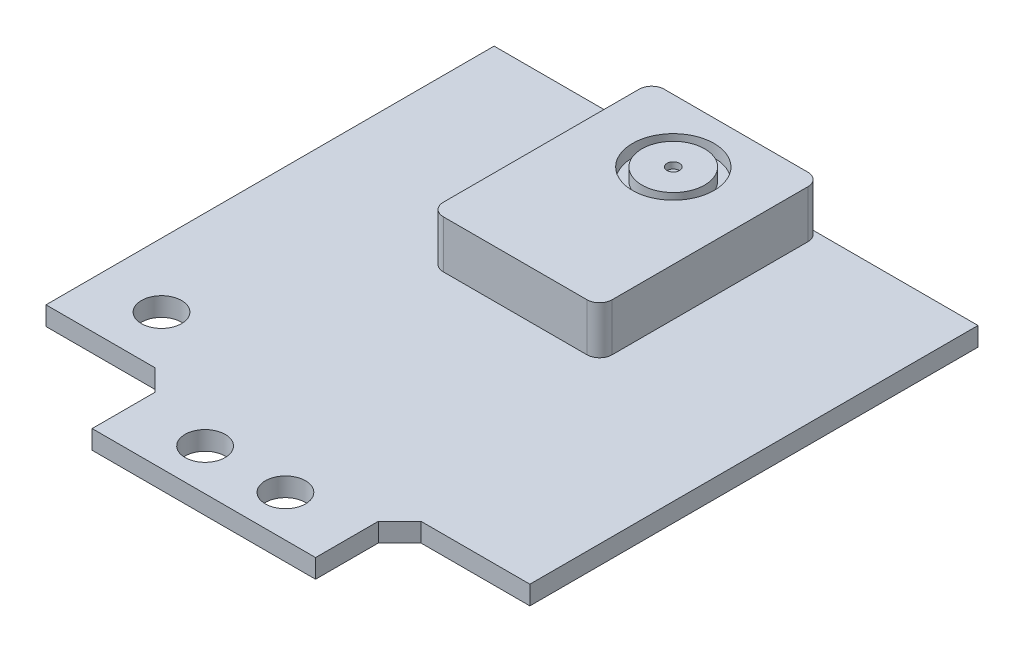
ISO-10303-21;
HEADER;
FILE_DESCRIPTION(('STEP AP214'),'2;1');
FILE_NAME('part.step','',(''),(''),'','','');
FILE_SCHEMA(('AUTOMOTIVE_DESIGN { 1 0 10303 214 1 1 1 1 }'));
ENDSEC;
DATA;
#1=APPLICATION_CONTEXT('core data for automotive mechanical design processes');
#2=APPLICATION_PROTOCOL_DEFINITION('international standard','automotive_design',2000,#1);
#3=PRODUCT_CONTEXT('',#1,'mechanical');
#4=PRODUCT('Part','Part','',(#3));
#5=PRODUCT_RELATED_PRODUCT_CATEGORY('part','',(#4));
#6=PRODUCT_DEFINITION_FORMATION('','',#4);
#7=PRODUCT_DEFINITION_CONTEXT('part definition',#1,'design');
#8=PRODUCT_DEFINITION('design','',#6,#7);
#9=PRODUCT_DEFINITION_SHAPE('','',#8);
#10=(LENGTH_UNIT() NAMED_UNIT(*) SI_UNIT(.MILLI.,.METRE.));
#11=(NAMED_UNIT(*) PLANE_ANGLE_UNIT() SI_UNIT($,.RADIAN.));
#12=(NAMED_UNIT(*) SI_UNIT($,.STERADIAN.) SOLID_ANGLE_UNIT());
#13=UNCERTAINTY_MEASURE_WITH_UNIT(LENGTH_MEASURE(1.E-05),#10,'distance_accuracy_value','');
#14=(GEOMETRIC_REPRESENTATION_CONTEXT(3) GLOBAL_UNCERTAINTY_ASSIGNED_CONTEXT((#13)) GLOBAL_UNIT_ASSIGNED_CONTEXT((#10,
#11,#12)) REPRESENTATION_CONTEXT('',''));
#15=CARTESIAN_POINT('',(0.,0.,0.));
#16=DIRECTION('',(0.,0.,1.));
#17=DIRECTION('',(1.,0.,0.));
#18=AXIS2_PLACEMENT_3D('',#15,#16,#17);
#19=CARTESIAN_POINT('',(6.725,5.3,0.));
#20=DIRECTION('',(-1.,0.,0.));
#21=DIRECTION('',(0.,0.,1.));
#22=AXIS2_PLACEMENT_3D('',#19,#20,#21);
#23=PLANE('',#22);
#24=DIRECTION('',(0.,0.,-1.));
#25=VECTOR('',#24,1.);
#26=CARTESIAN_POINT('',(6.725,1.5,0.));
#27=LINE('',#26,#25);
#28=CARTESIAN_POINT('',(6.725,1.5,-1.25));
#29=VERTEX_POINT('',#28);
#30=CARTESIAN_POINT('',(6.725,1.5,-16.85));
#31=VERTEX_POINT('',#30);
#32=EDGE_CURVE('E255',#29,#31,#27,.T.);
#33=ORIENTED_EDGE('',*,*,#32,.T.);
#34=DIRECTION('',(0.,-1.,0.));
#35=VECTOR('',#34,1.);
#36=CARTESIAN_POINT('',(6.725,5.3,-16.85));
#37=LINE('',#36,#35);
#38=CARTESIAN_POINT('',(6.725,5.3,-16.85));
#39=VERTEX_POINT('',#38);
#40=EDGE_CURVE('E13',#39,#31,#37,.T.);
#41=ORIENTED_EDGE('',*,*,#40,.F.);
#42=DIRECTION('',(0.,0.,-1.));
#43=VECTOR('',#42,1.);
#44=CARTESIAN_POINT('',(6.725,5.3,0.));
#45=LINE('',#44,#43);
#46=CARTESIAN_POINT('',(6.725,5.3,-1.25));
#47=VERTEX_POINT('',#46);
#48=EDGE_CURVE('E213',#47,#39,#45,.T.);
#49=ORIENTED_EDGE('',*,*,#48,.F.);
#50=DIRECTION('',(0.,-1.,0.));
#51=VECTOR('',#50,1.);
#52=CARTESIAN_POINT('',(6.725,5.3,-1.25));
#53=LINE('',#52,#51);
#54=EDGE_CURVE('E176',#47,#29,#53,.T.);
#55=ORIENTED_EDGE('',*,*,#54,.T.);
#56=EDGE_LOOP('',(#33,#41,#49,#55));
#57=FACE_BOUND('',#56,.T.);
#58=ADVANCED_FACE('F160',(#57),#23,.F.);
#59=CARTESIAN_POINT('',(5.725,5.3,-16.85));
#60=DIRECTION('',(0.,-1.,0.));
#61=DIRECTION('',(0.,0.,-1.));
#62=AXIS2_PLACEMENT_3D('',#59,#60,#61);
#63=CYLINDRICAL_SURFACE('',#62,1.);
#64=CARTESIAN_POINT('',(5.725,1.5,-16.85));
#65=DIRECTION('',(0.,-1.,0.));
#66=DIRECTION('',(0.,0.,-1.));
#67=AXIS2_PLACEMENT_3D('',#64,#65,#66);
#68=CIRCLE('',#67,1.);
#69=CARTESIAN_POINT('',(5.725,1.5,-17.85));
#70=VERTEX_POINT('',#69);
#71=EDGE_CURVE('E257',#70,#31,#68,.T.);
#72=ORIENTED_EDGE('',*,*,#71,.F.);
#73=DIRECTION('',(0.,-1.,0.));
#74=VECTOR('',#73,1.);
#75=CARTESIAN_POINT('',(5.725,5.3,-17.85));
#76=LINE('',#75,#74);
#77=CARTESIAN_POINT('',(5.725,5.3,-17.85));
#78=VERTEX_POINT('',#77);
#79=EDGE_CURVE('E168',#78,#70,#76,.T.);
#80=ORIENTED_EDGE('',*,*,#79,.F.);
#81=CARTESIAN_POINT('',(5.725,5.3,-16.85));
#82=DIRECTION('',(0.,-1.,0.));
#83=DIRECTION('',(0.,0.,-1.));
#84=AXIS2_PLACEMENT_3D('',#81,#82,#83);
#85=CIRCLE('',#84,1.);
#86=EDGE_CURVE('E295',#78,#39,#85,.T.);
#87=ORIENTED_EDGE('',*,*,#86,.T.);
#88=ORIENTED_EDGE('',*,*,#40,.T.);
#89=EDGE_LOOP('',(#72,#80,#87,#88));
#90=FACE_BOUND('',#89,.T.);
#91=ADVANCED_FACE('F294',(#90),#63,.T.);
#92=CARTESIAN_POINT('',(0.,5.3,-17.85));
#93=DIRECTION('',(0.,0.,1.));
#94=DIRECTION('',(1.,0.,0.));
#95=AXIS2_PLACEMENT_3D('',#92,#93,#94);
#96=PLANE('',#95);
#97=DIRECTION('',(-1.,0.,0.));
#98=VECTOR('',#97,1.);
#99=CARTESIAN_POINT('',(0.,1.5,-17.85));
#100=LINE('',#99,#98);
#101=CARTESIAN_POINT('',(-5.725,1.5,-17.85));
#102=VERTEX_POINT('',#101);
#103=EDGE_CURVE('E261',#70,#102,#100,.T.);
#104=ORIENTED_EDGE('',*,*,#103,.T.);
#105=DIRECTION('',(0.,-1.,0.));
#106=VECTOR('',#105,1.);
#107=CARTESIAN_POINT('',(-5.725,5.3,-17.85));
#108=LINE('',#107,#106);
#109=CARTESIAN_POINT('',(-5.725,5.3,-17.85));
#110=VERTEX_POINT('',#109);
#111=EDGE_CURVE('E281',#110,#102,#108,.T.);
#112=ORIENTED_EDGE('',*,*,#111,.F.);
#113=DIRECTION('',(-1.,0.,0.));
#114=VECTOR('',#113,1.);
#115=CARTESIAN_POINT('',(0.,5.3,-17.85));
#116=LINE('',#115,#114);
#117=EDGE_CURVE('E287',#78,#110,#116,.T.);
#118=ORIENTED_EDGE('',*,*,#117,.F.);
#119=ORIENTED_EDGE('',*,*,#79,.T.);
#120=EDGE_LOOP('',(#104,#112,#118,#119));
#121=FACE_BOUND('',#120,.T.);
#122=ADVANCED_FACE('F285',(#121),#96,.F.);
#123=CARTESIAN_POINT('',(-5.725,5.3,-16.85));
#124=DIRECTION('',(0.,-1.,0.));
#125=DIRECTION('',(0.,0.,-1.));
#126=AXIS2_PLACEMENT_3D('',#123,#124,#125);
#127=CYLINDRICAL_SURFACE('',#126,1.);
#128=CARTESIAN_POINT('',(-5.725,1.5,-16.85));
#129=DIRECTION('',(0.,-1.,0.));
#130=DIRECTION('',(0.,0.,-1.));
#131=AXIS2_PLACEMENT_3D('',#128,#129,#130);
#132=CIRCLE('',#131,1.);
#133=CARTESIAN_POINT('',(-6.725,1.5,-16.85));
#134=VERTEX_POINT('',#133);
#135=EDGE_CURVE('E264',#134,#102,#132,.T.);
#136=ORIENTED_EDGE('',*,*,#135,.F.);
#137=DIRECTION('',(0.,-1.,0.));
#138=VECTOR('',#137,1.);
#139=CARTESIAN_POINT('',(-6.725,5.3,-16.85));
#140=LINE('',#139,#138);
#141=CARTESIAN_POINT('',(-6.725,5.3,-16.85));
#142=VERTEX_POINT('',#141);
#143=EDGE_CURVE('E279',#142,#134,#140,.T.);
#144=ORIENTED_EDGE('',*,*,#143,.F.);
#145=CARTESIAN_POINT('',(-5.725,5.3,-16.85));
#146=DIRECTION('',(0.,-1.,0.));
#147=DIRECTION('',(0.,0.,-1.));
#148=AXIS2_PLACEMENT_3D('',#145,#146,#147);
#149=CIRCLE('',#148,1.);
#150=EDGE_CURVE('E498',#142,#110,#149,.T.);
#151=ORIENTED_EDGE('',*,*,#150,.T.);
#152=ORIENTED_EDGE('',*,*,#111,.T.);
#153=EDGE_LOOP('',(#136,#144,#151,#152));
#154=FACE_BOUND('',#153,.T.);
#155=ADVANCED_FACE('F315',(#154),#127,.T.);
#156=CARTESIAN_POINT('',(-6.725,5.3,0.));
#157=DIRECTION('',(-1.,0.,0.));
#158=DIRECTION('',(0.,0.,1.));
#159=AXIS2_PLACEMENT_3D('',#156,#157,#158);
#160=PLANE('',#159);
#161=DIRECTION('',(0.,0.,-1.));
#162=VECTOR('',#161,1.);
#163=CARTESIAN_POINT('',(-6.725,1.5,0.));
#164=LINE('',#163,#162);
#165=CARTESIAN_POINT('',(-6.725,1.5,-1.25));
#166=VERTEX_POINT('',#165);
#167=EDGE_CURVE('E267',#166,#134,#164,.T.);
#168=ORIENTED_EDGE('',*,*,#167,.F.);
#169=DIRECTION('',(0.,-1.,0.));
#170=VECTOR('',#169,1.);
#171=CARTESIAN_POINT('',(-6.725,5.3,-1.25));
#172=LINE('',#171,#170);
#173=CARTESIAN_POINT('',(-6.725,5.3,-1.25));
#174=VERTEX_POINT('',#173);
#175=EDGE_CURVE('E239',#174,#166,#172,.T.);
#176=ORIENTED_EDGE('',*,*,#175,.F.);
#177=DIRECTION('',(0.,0.,-1.));
#178=VECTOR('',#177,1.);
#179=CARTESIAN_POINT('',(-6.725,5.3,0.));
#180=LINE('',#179,#178);
#181=EDGE_CURVE('E247',#174,#142,#180,.T.);
#182=ORIENTED_EDGE('',*,*,#181,.T.);
#183=ORIENTED_EDGE('',*,*,#143,.T.);
#184=EDGE_LOOP('',(#168,#176,#182,#183));
#185=FACE_BOUND('',#184,.T.);
#186=ADVANCED_FACE('F320',(#185),#160,.T.);
#187=CARTESIAN_POINT('',(-5.725,5.3,-1.25));
#188=DIRECTION('',(0.,-1.,0.));
#189=DIRECTION('',(0.,0.,-1.));
#190=AXIS2_PLACEMENT_3D('',#187,#188,#189);
#191=CYLINDRICAL_SURFACE('',#190,1.);
#192=CARTESIAN_POINT('',(-5.725,1.5,-1.25));
#193=DIRECTION('',(0.,-1.,0.));
#194=DIRECTION('',(0.,0.,-1.));
#195=AXIS2_PLACEMENT_3D('',#192,#193,#194);
#196=CIRCLE('',#195,1.);
#197=CARTESIAN_POINT('',(-5.725,1.5,-0.249999999999999));
#198=VERTEX_POINT('',#197);
#199=EDGE_CURVE('E235',#198,#166,#196,.T.);
#200=ORIENTED_EDGE('',*,*,#199,.F.);
#201=DIRECTION('',(0.,-1.,0.));
#202=VECTOR('',#201,1.);
#203=CARTESIAN_POINT('',(-5.725,5.3,-0.249999999999999));
#204=LINE('',#203,#202);
#205=CARTESIAN_POINT('',(-5.725,5.3,-0.249999999999999));
#206=VERTEX_POINT('',#205);
#207=EDGE_CURVE('E230',#206,#198,#204,.T.);
#208=ORIENTED_EDGE('',*,*,#207,.F.);
#209=CARTESIAN_POINT('',(-5.725,5.3,-1.25));
#210=DIRECTION('',(0.,-1.,0.));
#211=DIRECTION('',(0.,0.,-1.));
#212=AXIS2_PLACEMENT_3D('',#209,#210,#211);
#213=CIRCLE('',#212,1.);
#214=EDGE_CURVE('E233',#206,#174,#213,.T.);
#215=ORIENTED_EDGE('',*,*,#214,.T.);
#216=ORIENTED_EDGE('',*,*,#175,.T.);
#217=EDGE_LOOP('',(#200,#208,#215,#216));
#218=FACE_BOUND('',#217,.T.);
#219=ADVANCED_FACE('F232',(#218),#191,.T.);
#220=CARTESIAN_POINT('',(0.,5.3,-0.249999999999999));
#221=DIRECTION('',(0.,0.,1.));
#222=DIRECTION('',(1.,0.,0.));
#223=AXIS2_PLACEMENT_3D('',#220,#221,#222);
#224=PLANE('',#223);
#225=DIRECTION('',(-1.,0.,0.));
#226=VECTOR('',#225,1.);
#227=CARTESIAN_POINT('',(0.,1.5,-0.249999999999999));
#228=LINE('',#227,#226);
#229=CARTESIAN_POINT('',(5.725,1.5,-0.25));
#230=VERTEX_POINT('',#229);
#231=EDGE_CURVE('E271',#230,#198,#228,.T.);
#232=ORIENTED_EDGE('',*,*,#231,.F.);
#233=DIRECTION('',(0.,-1.,0.));
#234=VECTOR('',#233,1.);
#235=CARTESIAN_POINT('',(5.725,5.3,-0.25));
#236=LINE('',#235,#234);
#237=CARTESIAN_POINT('',(5.725,5.3,-0.25));
#238=VERTEX_POINT('',#237);
#239=EDGE_CURVE('E201',#238,#230,#236,.T.);
#240=ORIENTED_EDGE('',*,*,#239,.F.);
#241=DIRECTION('',(-1.,0.,0.));
#242=VECTOR('',#241,1.);
#243=CARTESIAN_POINT('',(0.,5.3,-0.249999999999999));
#244=LINE('',#243,#242);
#245=EDGE_CURVE('E244',#238,#206,#244,.T.);
#246=ORIENTED_EDGE('',*,*,#245,.T.);
#247=ORIENTED_EDGE('',*,*,#207,.T.);
#248=EDGE_LOOP('',(#232,#240,#246,#247));
#249=FACE_BOUND('',#248,.T.);
#250=ADVANCED_FACE('F249',(#249),#224,.T.);
#251=CARTESIAN_POINT('',(5.725,5.3,-1.25));
#252=DIRECTION('',(0.,-1.,0.));
#253=DIRECTION('',(0.,0.,-1.));
#254=AXIS2_PLACEMENT_3D('',#251,#252,#253);
#255=CYLINDRICAL_SURFACE('',#254,1.);
#256=CARTESIAN_POINT('',(5.725,1.5,-1.25));
#257=DIRECTION('',(0.,-1.,0.));
#258=DIRECTION('',(0.,0.,-1.));
#259=AXIS2_PLACEMENT_3D('',#256,#257,#258);
#260=CIRCLE('',#259,1.);
#261=EDGE_CURVE('E273',#29,#230,#260,.T.);
#262=ORIENTED_EDGE('',*,*,#261,.F.);
#263=ORIENTED_EDGE('',*,*,#54,.F.);
#264=CARTESIAN_POINT('',(5.725,5.3,-1.25));
#265=DIRECTION('',(0.,-1.,0.));
#266=DIRECTION('',(0.,0.,-1.));
#267=AXIS2_PLACEMENT_3D('',#264,#265,#266);
#268=CIRCLE('',#267,1.);
#269=EDGE_CURVE('E250',#47,#238,#268,.T.);
#270=ORIENTED_EDGE('',*,*,#269,.T.);
#271=ORIENTED_EDGE('',*,*,#239,.T.);
#272=EDGE_LOOP('',(#262,#263,#270,#271));
#273=FACE_BOUND('',#272,.T.);
#274=ADVANCED_FACE('F296',(#273),#255,.T.);
#275=CARTESIAN_POINT('',(5.725,5.3,-16.85));
#276=DIRECTION('',(0.,-1.,0.));
#277=DIRECTION('',(0.,0.,-1.));
#278=AXIS2_PLACEMENT_3D('',#275,#276,#277);
#279=PLANE('',#278);
#280=CARTESIAN_POINT('',(0.,5.3,-12.85));
#281=DIRECTION('',(0.,-1.,0.));
#282=DIRECTION('',(0.,0.,-1.));
#283=AXIS2_PLACEMENT_3D('',#280,#281,#282);
#284=CIRCLE('',#283,3.25);
#285=CARTESIAN_POINT('',(0.,5.3,-16.1));
#286=VERTEX_POINT('',#285);
#287=EDGE_CURVE('E489',#286,#286,#284,.T.);
#288=ORIENTED_EDGE('',*,*,#287,.T.);
#289=EDGE_LOOP('',(#288));
#290=FACE_BOUND('',#289,.T.);
#291=ORIENTED_EDGE('',*,*,#48,.T.);
#292=ORIENTED_EDGE('',*,*,#86,.F.);
#293=ORIENTED_EDGE('',*,*,#117,.T.);
#294=ORIENTED_EDGE('',*,*,#150,.F.);
#295=ORIENTED_EDGE('',*,*,#181,.F.);
#296=ORIENTED_EDGE('',*,*,#214,.F.);
#297=ORIENTED_EDGE('',*,*,#245,.F.);
#298=ORIENTED_EDGE('',*,*,#269,.F.);
#299=EDGE_LOOP('',(#291,#292,#293,#294,#295,#296,#297,#298));
#300=FACE_BOUND('',#299,.T.);
#301=ADVANCED_FACE('F243',(#290,#300),#279,.F.);
#302=CARTESIAN_POINT('',(5.725,1.5,-16.85));
#303=DIRECTION('',(0.,-1.,0.));
#304=DIRECTION('',(0.,0.,-1.));
#305=AXIS2_PLACEMENT_3D('',#302,#303,#304);
#306=PLANE('',#305);
#307=ORIENTED_EDGE('',*,*,#32,.F.);
#308=ORIENTED_EDGE('',*,*,#261,.T.);
#309=ORIENTED_EDGE('',*,*,#231,.T.);
#310=ORIENTED_EDGE('',*,*,#199,.T.);
#311=ORIENTED_EDGE('',*,*,#167,.T.);
#312=ORIENTED_EDGE('',*,*,#135,.T.);
#313=ORIENTED_EDGE('',*,*,#103,.F.);
#314=ORIENTED_EDGE('',*,*,#71,.T.);
#315=EDGE_LOOP('',(#307,#308,#309,#310,#311,#312,#313,#314));
#316=FACE_BOUND('',#315,.T.);
#317=ADVANCED_FACE('F292',(#316),#306,.T.);
#318=CARTESIAN_POINT('',(0.,4.3,-12.85));
#319=DIRECTION('',(0.,-1.,0.));
#320=DIRECTION('',(0.,0.,-1.));
#321=AXIS2_PLACEMENT_3D('',#318,#319,#320);
#322=PLANE('',#321);
#323=CARTESIAN_POINT('',(0.,4.3,-12.85));
#324=DIRECTION('',(0.,-1.,0.));
#325=DIRECTION('',(0.,0.,-1.));
#326=AXIS2_PLACEMENT_3D('',#323,#324,#325);
#327=CIRCLE('',#326,3.25);
#328=CARTESIAN_POINT('',(0.,4.3,-16.1));
#329=VERTEX_POINT('',#328);
#330=EDGE_CURVE('E258',#329,#329,#327,.T.);
#331=ORIENTED_EDGE('',*,*,#330,.F.);
#332=EDGE_LOOP('',(#331));
#333=FACE_BOUND('',#332,.T.);
#334=CARTESIAN_POINT('',(0.,4.3,-12.85));
#335=DIRECTION('',(0.,-1.,0.));
#336=DIRECTION('',(0.,0.,-1.));
#337=AXIS2_PLACEMENT_3D('',#334,#335,#336);
#338=CIRCLE('',#337,2.5);
#339=CARTESIAN_POINT('',(0.,4.3,-15.35));
#340=VERTEX_POINT('',#339);
#341=EDGE_CURVE('E483',#340,#340,#338,.T.);
#342=ORIENTED_EDGE('',*,*,#341,.T.);
#343=EDGE_LOOP('',(#342));
#344=FACE_BOUND('',#343,.T.);
#345=ADVANCED_FACE('F354',(#333,#344),#322,.F.);
#346=CARTESIAN_POINT('',(0.,4.3,-12.85));
#347=DIRECTION('',(0.,1.,0.));
#348=DIRECTION('',(0.,0.,1.));
#349=AXIS2_PLACEMENT_3D('',#346,#347,#348);
#350=CYLINDRICAL_SURFACE('',#349,3.25);
#351=ORIENTED_EDGE('',*,*,#330,.T.);
#352=EDGE_LOOP('',(#351));
#353=FACE_BOUND('',#352,.T.);
#354=ORIENTED_EDGE('',*,*,#287,.F.);
#355=EDGE_LOOP('',(#354));
#356=FACE_BOUND('',#355,.T.);
#357=ADVANCED_FACE('F362',(#353,#356),#350,.F.);
#358=CARTESIAN_POINT('',(0.,4.3,-12.85));
#359=DIRECTION('',(0.,1.,0.));
#360=DIRECTION('',(0.,0.,1.));
#361=AXIS2_PLACEMENT_3D('',#358,#359,#360);
#362=CYLINDRICAL_SURFACE('',#361,2.5);
#363=ORIENTED_EDGE('',*,*,#341,.F.);
#364=EDGE_LOOP('',(#363));
#365=FACE_BOUND('',#364,.T.);
#366=CARTESIAN_POINT('',(0.,5.3,-12.85));
#367=DIRECTION('',(0.,-1.,0.));
#368=DIRECTION('',(0.,0.,-1.));
#369=AXIS2_PLACEMENT_3D('',#366,#367,#368);
#370=CIRCLE('',#369,2.5);
#371=CARTESIAN_POINT('',(0.,5.3,-15.35));
#372=VERTEX_POINT('',#371);
#373=EDGE_CURVE('E479',#372,#372,#370,.T.);
#374=ORIENTED_EDGE('',*,*,#373,.T.);
#375=EDGE_LOOP('',(#374));
#376=FACE_BOUND('',#375,.T.);
#377=ADVANCED_FACE('F372',(#365,#376),#362,.T.);
#378=CARTESIAN_POINT('',(0.,5.3,-12.85));
#379=DIRECTION('',(0.,1.,0.));
#380=DIRECTION('',(0.,0.,1.));
#381=AXIS2_PLACEMENT_3D('',#378,#379,#380);
#382=CIRCLE('',#381,0.5);
#383=CARTESIAN_POINT('',(0.,5.3,-12.35));
#384=VERTEX_POINT('',#383);
#385=EDGE_CURVE('E480',#384,#384,#382,.T.);
#386=ORIENTED_EDGE('',*,*,#385,.F.);
#387=EDGE_LOOP('',(#386));
#388=FACE_BOUND('',#387,.T.);
#389=ORIENTED_EDGE('',*,*,#373,.F.);
#390=EDGE_LOOP('',(#389));
#391=FACE_BOUND('',#390,.T.);
#392=ADVANCED_FACE('F305',(#388,#391),#279,.F.);
#393=CARTESIAN_POINT('',(0.,4.8,-12.85));
#394=DIRECTION('',(0.,1.,0.));
#395=DIRECTION('',(0.,0.,1.));
#396=AXIS2_PLACEMENT_3D('',#393,#394,#395);
#397=CYLINDRICAL_SURFACE('',#396,0.5);
#398=CARTESIAN_POINT('',(0.,4.8,-12.85));
#399=DIRECTION('',(0.,1.,0.));
#400=DIRECTION('',(0.,0.,1.));
#401=AXIS2_PLACEMENT_3D('',#398,#399,#400);
#402=CIRCLE('',#401,0.5);
#403=CARTESIAN_POINT('',(0.,4.8,-12.35));
#404=VERTEX_POINT('',#403);
#405=EDGE_CURVE('E478',#404,#404,#402,.T.);
#406=ORIENTED_EDGE('',*,*,#405,.F.);
#407=EDGE_LOOP('',(#406));
#408=FACE_BOUND('',#407,.T.);
#409=ORIENTED_EDGE('',*,*,#385,.T.);
#410=EDGE_LOOP('',(#409));
#411=FACE_BOUND('',#410,.T.);
#412=ADVANCED_FACE('F392',(#408,#411),#397,.F.);
#413=CARTESIAN_POINT('',(0.,4.8,-12.85));
#414=DIRECTION('',(0.,1.,0.));
#415=DIRECTION('',(0.,0.,1.));
#416=AXIS2_PLACEMENT_3D('',#413,#414,#415);
#417=PLANE('',#416);
#418=ORIENTED_EDGE('',*,*,#405,.T.);
#419=EDGE_LOOP('',(#418));
#420=FACE_BOUND('',#419,.T.);
#421=ADVANCED_FACE('F400',(#420),#417,.T.);
#422=CLOSED_SHELL('',(#58,#91,#122,#155,#186,#219,#250,#274,#301,#317,#345,#357,#377,#392,#412,#421));
#423=MANIFOLD_SOLID_BREP('B2',#422);
#424=CARTESIAN_POINT('',(0.,1.5,0.));
#425=DIRECTION('',(0.,-1.,0.));
#426=DIRECTION('',(0.,0.,-1.));
#427=AXIS2_PLACEMENT_3D('',#424,#425,#426);
#428=PLANE('',#427);
#429=CARTESIAN_POINT('',(3.20000000000001,1.5,21.25));
#430=DIRECTION('',(0.,1.,0.));
#431=DIRECTION('',(0.,0.,1.));
#432=AXIS2_PLACEMENT_3D('',#429,#430,#431);
#433=CIRCLE('',#432,1.6);
#434=CARTESIAN_POINT('',(3.20000000000001,1.5,22.85));
#435=VERTEX_POINT('',#434);
#436=EDGE_CURVE('E720',#435,#435,#433,.F.);
#437=ORIENTED_EDGE('',*,*,#436,.T.);
#438=EDGE_LOOP('',(#437));
#439=FACE_BOUND('',#438,.T.);
#440=DIRECTION('',(1.,0.,0.));
#441=VECTOR('',#440,1.);
#442=CARTESIAN_POINT('',(-19.275,1.5,-17.85));
#443=LINE('',#442,#441);
#444=CARTESIAN_POINT('',(-19.275,1.5,-17.85));
#445=VERTEX_POINT('',#444);
#446=CARTESIAN_POINT('',(19.275,1.5,-17.85));
#447=VERTEX_POINT('',#446);
#448=EDGE_CURVE('E666',#445,#447,#443,.T.);
#449=ORIENTED_EDGE('',*,*,#448,.F.);
#450=DIRECTION('',(0.,0.,1.));
#451=VECTOR('',#450,1.);
#452=CARTESIAN_POINT('',(-19.275,1.5,-17.85));
#453=LINE('',#452,#451);
#454=CARTESIAN_POINT('',(-19.275,1.5,17.85));
#455=VERTEX_POINT('',#454);
#456=EDGE_CURVE('E620',#445,#455,#453,.T.);
#457=ORIENTED_EDGE('',*,*,#456,.T.);
#458=DIRECTION('',(1.,0.,0.));
#459=VECTOR('',#458,1.);
#460=CARTESIAN_POINT('',(-19.275,1.5,17.85));
#461=LINE('',#460,#459);
#462=CARTESIAN_POINT('',(-10.6,1.5,17.85));
#463=VERTEX_POINT('',#462);
#464=EDGE_CURVE('E613',#455,#463,#461,.T.);
#465=ORIENTED_EDGE('',*,*,#464,.T.);
#466=DIRECTION('',(0.707106781186547,0.,0.707106781186548));
#467=VECTOR('',#466,1.);
#468=CARTESIAN_POINT('',(-10.6,1.5,17.85));
#469=LINE('',#468,#467);
#470=CARTESIAN_POINT('',(-8.9,1.5,19.55));
#471=VERTEX_POINT('',#470);
#472=EDGE_CURVE('E618',#463,#471,#469,.T.);
#473=ORIENTED_EDGE('',*,*,#472,.T.);
#474=DIRECTION('',(0.,0.,1.));
#475=VECTOR('',#474,1.);
#476=CARTESIAN_POINT('',(-8.9,1.5,19.55));
#477=LINE('',#476,#475);
#478=CARTESIAN_POINT('',(-8.89999999999999,1.5,24.55));
#479=VERTEX_POINT('',#478);
#480=EDGE_CURVE('E635',#471,#479,#477,.T.);
#481=ORIENTED_EDGE('',*,*,#480,.T.);
#482=DIRECTION('',(1.,0.,0.));
#483=VECTOR('',#482,1.);
#484=CARTESIAN_POINT('',(-8.89999999999999,1.5,24.55));
#485=LINE('',#484,#483);
#486=CARTESIAN_POINT('',(8.90000000000001,1.5,24.55));
#487=VERTEX_POINT('',#486);
#488=EDGE_CURVE('E637',#479,#487,#485,.T.);
#489=ORIENTED_EDGE('',*,*,#488,.T.);
#490=DIRECTION('',(0.,0.,1.));
#491=VECTOR('',#490,1.);
#492=CARTESIAN_POINT('',(8.90000000000001,1.5,19.55));
#493=LINE('',#492,#491);
#494=CARTESIAN_POINT('',(8.90000000000001,1.5,19.55));
#495=VERTEX_POINT('',#494);
#496=EDGE_CURVE('E694',#495,#487,#493,.T.);
#497=ORIENTED_EDGE('',*,*,#496,.F.);
#498=DIRECTION('',(-0.707106781186547,0.,0.707106781186548));
#499=VECTOR('',#498,1.);
#500=CARTESIAN_POINT('',(10.6,1.5,17.85));
#501=LINE('',#500,#499);
#502=CARTESIAN_POINT('',(10.6,1.5,17.85));
#503=VERTEX_POINT('',#502);
#504=EDGE_CURVE('E701',#503,#495,#501,.T.);
#505=ORIENTED_EDGE('',*,*,#504,.F.);
#506=DIRECTION('',(-1.,0.,0.));
#507=VECTOR('',#506,1.);
#508=CARTESIAN_POINT('',(19.275,1.5,17.85));
#509=LINE('',#508,#507);
#510=CARTESIAN_POINT('',(19.275,1.5,17.85));
#511=VERTEX_POINT('',#510);
#512=EDGE_CURVE('E703',#511,#503,#509,.T.);
#513=ORIENTED_EDGE('',*,*,#512,.F.);
#514=DIRECTION('',(0.,0.,1.));
#515=VECTOR('',#514,1.);
#516=CARTESIAN_POINT('',(19.275,1.5,-17.85));
#517=LINE('',#516,#515);
#518=EDGE_CURVE('E708',#447,#511,#517,.T.);
#519=ORIENTED_EDGE('',*,*,#518,.F.);
#520=EDGE_LOOP('',(#449,#457,#465,#473,#481,#489,#497,#505,#513,#519));
#521=FACE_BOUND('',#520,.T.);
#522=CARTESIAN_POINT('',(-14.175,1.5,13.75));
#523=DIRECTION('',(0.,1.,0.));
#524=DIRECTION('',(0.,0.,1.));
#525=AXIS2_PLACEMENT_3D('',#522,#523,#524);
#526=CIRCLE('',#525,1.6);
#527=CARTESIAN_POINT('',(-14.175,1.5,15.35));
#528=VERTEX_POINT('',#527);
#529=EDGE_CURVE('E646',#528,#528,#526,.T.);
#530=ORIENTED_EDGE('',*,*,#529,.F.);
#531=EDGE_LOOP('',(#530));
#532=FACE_BOUND('',#531,.T.);
#533=CARTESIAN_POINT('',(-3.19999999999999,1.5,21.25));
#534=DIRECTION('',(0.,1.,0.));
#535=DIRECTION('',(0.,0.,1.));
#536=AXIS2_PLACEMENT_3D('',#533,#534,#535);
#537=CIRCLE('',#536,1.6);
#538=CARTESIAN_POINT('',(-3.19999999999999,1.5,22.85));
#539=VERTEX_POINT('',#538);
#540=EDGE_CURVE('E714',#539,#539,#537,.T.);
#541=ORIENTED_EDGE('',*,*,#540,.F.);
#542=EDGE_LOOP('',(#541));
#543=FACE_BOUND('',#542,.T.);
#544=ADVANCED_FACE('F531',(#439,#521,#532,#543),#428,.F.);
#545=CARTESIAN_POINT('',(0.,0.,0.));
#546=DIRECTION('',(0.,-1.,0.));
#547=DIRECTION('',(0.,0.,-1.));
#548=AXIS2_PLACEMENT_3D('',#545,#546,#547);
#549=PLANE('',#548);
#550=CARTESIAN_POINT('',(3.20000000000001,0.,21.25));
#551=DIRECTION('',(0.,1.,0.));
#552=DIRECTION('',(0.,0.,1.));
#553=AXIS2_PLACEMENT_3D('',#550,#551,#552);
#554=CIRCLE('',#553,1.6);
#555=CARTESIAN_POINT('',(3.20000000000001,0.,22.85));
#556=VERTEX_POINT('',#555);
#557=EDGE_CURVE('E723',#556,#556,#554,.F.);
#558=ORIENTED_EDGE('',*,*,#557,.F.);
#559=EDGE_LOOP('',(#558));
#560=FACE_BOUND('',#559,.T.);
#561=CARTESIAN_POINT('',(-14.175,0.,13.75));
#562=DIRECTION('',(0.,1.,0.));
#563=DIRECTION('',(0.,0.,1.));
#564=AXIS2_PLACEMENT_3D('',#561,#562,#563);
#565=CIRCLE('',#564,1.6);
#566=CARTESIAN_POINT('',(-14.175,0.,15.35));
#567=VERTEX_POINT('',#566);
#568=EDGE_CURVE('E711',#567,#567,#565,.T.);
#569=ORIENTED_EDGE('',*,*,#568,.T.);
#570=EDGE_LOOP('',(#569));
#571=FACE_BOUND('',#570,.T.);
#572=DIRECTION('',(1.,0.,0.));
#573=VECTOR('',#572,1.);
#574=CARTESIAN_POINT('',(-19.275,0.,-17.85));
#575=LINE('',#574,#573);
#576=CARTESIAN_POINT('',(-19.275,0.,-17.85));
#577=VERTEX_POINT('',#576);
#578=CARTESIAN_POINT('',(19.275,0.,-17.85));
#579=VERTEX_POINT('',#578);
#580=EDGE_CURVE('E642',#577,#579,#575,.T.);
#581=ORIENTED_EDGE('',*,*,#580,.T.);
#582=DIRECTION('',(0.,0.,1.));
#583=VECTOR('',#582,1.);
#584=CARTESIAN_POINT('',(19.275,0.,-17.85));
#585=LINE('',#584,#583);
#586=CARTESIAN_POINT('',(19.275,0.,17.85));
#587=VERTEX_POINT('',#586);
#588=EDGE_CURVE('E645',#579,#587,#585,.T.);
#589=ORIENTED_EDGE('',*,*,#588,.T.);
#590=DIRECTION('',(-1.,0.,0.));
#591=VECTOR('',#590,1.);
#592=CARTESIAN_POINT('',(19.275,0.,17.85));
#593=LINE('',#592,#591);
#594=CARTESIAN_POINT('',(10.6,0.,17.85));
#595=VERTEX_POINT('',#594);
#596=EDGE_CURVE('E649',#587,#595,#593,.T.);
#597=ORIENTED_EDGE('',*,*,#596,.T.);
#598=DIRECTION('',(-0.707106781186547,0.,0.707106781186548));
#599=VECTOR('',#598,1.);
#600=CARTESIAN_POINT('',(10.6,0.,17.85));
#601=LINE('',#600,#599);
#602=CARTESIAN_POINT('',(8.90000000000001,0.,19.55));
#603=VERTEX_POINT('',#602);
#604=EDGE_CURVE('E652',#595,#603,#601,.T.);
#605=ORIENTED_EDGE('',*,*,#604,.T.);
#606=DIRECTION('',(0.,0.,1.));
#607=VECTOR('',#606,1.);
#608=CARTESIAN_POINT('',(8.90000000000001,0.,19.55));
#609=LINE('',#608,#607);
#610=CARTESIAN_POINT('',(8.90000000000001,0.,24.55));
#611=VERTEX_POINT('',#610);
#612=EDGE_CURVE('E655',#603,#611,#609,.T.);
#613=ORIENTED_EDGE('',*,*,#612,.T.);
#614=DIRECTION('',(1.,0.,0.));
#615=VECTOR('',#614,1.);
#616=CARTESIAN_POINT('',(-8.89999999999999,0.,24.55));
#617=LINE('',#616,#615);
#618=CARTESIAN_POINT('',(-8.89999999999999,0.,24.55));
#619=VERTEX_POINT('',#618);
#620=EDGE_CURVE('E658',#619,#611,#617,.T.);
#621=ORIENTED_EDGE('',*,*,#620,.F.);
#622=DIRECTION('',(0.,0.,1.));
#623=VECTOR('',#622,1.);
#624=CARTESIAN_POINT('',(-8.9,0.,19.55));
#625=LINE('',#624,#623);
#626=CARTESIAN_POINT('',(-8.9,0.,19.55));
#627=VERTEX_POINT('',#626);
#628=EDGE_CURVE('E661',#627,#619,#625,.T.);
#629=ORIENTED_EDGE('',*,*,#628,.F.);
#630=DIRECTION('',(0.707106781186547,0.,0.707106781186548));
#631=VECTOR('',#630,1.);
#632=CARTESIAN_POINT('',(-10.6,0.,17.85));
#633=LINE('',#632,#631);
#634=CARTESIAN_POINT('',(-10.6,0.,17.85));
#635=VERTEX_POINT('',#634);
#636=EDGE_CURVE('E663',#635,#627,#633,.T.);
#637=ORIENTED_EDGE('',*,*,#636,.F.);
#638=DIRECTION('',(1.,0.,0.));
#639=VECTOR('',#638,1.);
#640=CARTESIAN_POINT('',(-19.275,0.,17.85));
#641=LINE('',#640,#639);
#642=CARTESIAN_POINT('',(-19.275,0.,17.85));
#643=VERTEX_POINT('',#642);
#644=EDGE_CURVE('E627',#643,#635,#641,.T.);
#645=ORIENTED_EDGE('',*,*,#644,.F.);
#646=DIRECTION('',(0.,0.,1.));
#647=VECTOR('',#646,1.);
#648=CARTESIAN_POINT('',(-19.275,0.,-17.85));
#649=LINE('',#648,#647);
#650=EDGE_CURVE('E583',#577,#643,#649,.T.);
#651=ORIENTED_EDGE('',*,*,#650,.F.);
#652=EDGE_LOOP('',(#581,#589,#597,#605,#613,#621,#629,#637,#645,#651));
#653=FACE_BOUND('',#652,.T.);
#654=CARTESIAN_POINT('',(-3.19999999999999,0.,21.25));
#655=DIRECTION('',(0.,1.,0.));
#656=DIRECTION('',(0.,0.,1.));
#657=AXIS2_PLACEMENT_3D('',#654,#655,#656);
#658=CIRCLE('',#657,1.6);
#659=CARTESIAN_POINT('',(-3.19999999999999,0.,22.85));
#660=VERTEX_POINT('',#659);
#661=EDGE_CURVE('E717',#660,#660,#658,.T.);
#662=ORIENTED_EDGE('',*,*,#661,.T.);
#663=EDGE_LOOP('',(#662));
#664=FACE_BOUND('',#663,.T.);
#665=ADVANCED_FACE('F682',(#560,#571,#653,#664),#549,.T.);
#666=CARTESIAN_POINT('',(-19.275,1.5,-17.85));
#667=DIRECTION('',(0.,0.,-1.));
#668=DIRECTION('',(-1.,0.,0.));
#669=AXIS2_PLACEMENT_3D('',#666,#667,#668);
#670=PLANE('',#669);
#671=ORIENTED_EDGE('',*,*,#580,.F.);
#672=DIRECTION('',(0.,-1.,0.));
#673=VECTOR('',#672,1.);
#674=CARTESIAN_POINT('',(-19.275,1.5,-17.85));
#675=LINE('',#674,#673);
#676=EDGE_CURVE('E158',#445,#577,#675,.T.);
#677=ORIENTED_EDGE('',*,*,#676,.F.);
#678=ORIENTED_EDGE('',*,*,#448,.T.);
#679=DIRECTION('',(0.,-1.,0.));
#680=VECTOR('',#679,1.);
#681=CARTESIAN_POINT('',(19.275,1.5,-17.85));
#682=LINE('',#681,#680);
#683=EDGE_CURVE('E535',#447,#579,#682,.T.);
#684=ORIENTED_EDGE('',*,*,#683,.T.);
#685=EDGE_LOOP('',(#671,#677,#678,#684));
#686=FACE_BOUND('',#685,.T.);
#687=ADVANCED_FACE('F533',(#686),#670,.T.);
#688=CARTESIAN_POINT('',(-19.275,1.5,-17.85));
#689=DIRECTION('',(1.,0.,0.));
#690=DIRECTION('',(0.,0.,-1.));
#691=AXIS2_PLACEMENT_3D('',#688,#689,#690);
#692=PLANE('',#691);
#693=ORIENTED_EDGE('',*,*,#650,.T.);
#694=DIRECTION('',(0.,-1.,0.));
#695=VECTOR('',#694,1.);
#696=CARTESIAN_POINT('',(-19.275,1.5,17.85));
#697=LINE('',#696,#695);
#698=EDGE_CURVE('E541',#455,#643,#697,.T.);
#699=ORIENTED_EDGE('',*,*,#698,.F.);
#700=ORIENTED_EDGE('',*,*,#456,.F.);
#701=ORIENTED_EDGE('',*,*,#676,.T.);
#702=EDGE_LOOP('',(#693,#699,#700,#701));
#703=FACE_BOUND('',#702,.T.);
#704=ADVANCED_FACE('F758',(#703),#692,.F.);
#705=CARTESIAN_POINT('',(-19.275,1.5,17.85));
#706=DIRECTION('',(0.,0.,-1.));
#707=DIRECTION('',(-1.,0.,0.));
#708=AXIS2_PLACEMENT_3D('',#705,#706,#707);
#709=PLANE('',#708);
#710=ORIENTED_EDGE('',*,*,#644,.T.);
#711=DIRECTION('',(0.,-1.,0.));
#712=VECTOR('',#711,1.);
#713=CARTESIAN_POINT('',(-10.6,1.5,17.85));
#714=LINE('',#713,#712);
#715=EDGE_CURVE('E624',#463,#635,#714,.T.);
#716=ORIENTED_EDGE('',*,*,#715,.F.);
#717=ORIENTED_EDGE('',*,*,#464,.F.);
#718=ORIENTED_EDGE('',*,*,#698,.T.);
#719=EDGE_LOOP('',(#710,#716,#717,#718));
#720=FACE_BOUND('',#719,.T.);
#721=ADVANCED_FACE('F625',(#720),#709,.F.);
#722=CARTESIAN_POINT('',(-10.6,1.5,17.85));
#723=DIRECTION('',(0.707106781186548,0.,-0.707106781186547));
#724=DIRECTION('',(-0.707106781186547,0.,-0.707106781186548));
#725=AXIS2_PLACEMENT_3D('',#722,#723,#724);
#726=PLANE('',#725);
#727=ORIENTED_EDGE('',*,*,#636,.T.);
#728=DIRECTION('',(0.,-1.,0.));
#729=VECTOR('',#728,1.);
#730=CARTESIAN_POINT('',(-8.9,1.5,19.55));
#731=LINE('',#730,#729);
#732=EDGE_CURVE('E630',#471,#627,#731,.T.);
#733=ORIENTED_EDGE('',*,*,#732,.F.);
#734=ORIENTED_EDGE('',*,*,#472,.F.);
#735=ORIENTED_EDGE('',*,*,#715,.T.);
#736=EDGE_LOOP('',(#727,#733,#734,#735));
#737=FACE_BOUND('',#736,.T.);
#738=ADVANCED_FACE('F632',(#737),#726,.F.);
#739=CARTESIAN_POINT('',(-8.9,1.5,19.55));
#740=DIRECTION('',(1.,0.,0.));
#741=DIRECTION('',(0.,0.,-1.));
#742=AXIS2_PLACEMENT_3D('',#739,#740,#741);
#743=PLANE('',#742);
#744=ORIENTED_EDGE('',*,*,#628,.T.);
#745=DIRECTION('',(0.,-1.,0.));
#746=VECTOR('',#745,1.);
#747=CARTESIAN_POINT('',(-8.89999999999999,1.5,24.55));
#748=LINE('',#747,#746);
#749=EDGE_CURVE('E670',#479,#619,#748,.T.);
#750=ORIENTED_EDGE('',*,*,#749,.F.);
#751=ORIENTED_EDGE('',*,*,#480,.F.);
#752=ORIENTED_EDGE('',*,*,#732,.T.);
#753=EDGE_LOOP('',(#744,#750,#751,#752));
#754=FACE_BOUND('',#753,.T.);
#755=ADVANCED_FACE('F687',(#754),#743,.F.);
#756=CARTESIAN_POINT('',(-8.89999999999999,1.5,24.55));
#757=DIRECTION('',(0.,0.,-1.));
#758=DIRECTION('',(-1.,0.,0.));
#759=AXIS2_PLACEMENT_3D('',#756,#757,#758);
#760=PLANE('',#759);
#761=ORIENTED_EDGE('',*,*,#620,.T.);
#762=DIRECTION('',(0.,-1.,0.));
#763=VECTOR('',#762,1.);
#764=CARTESIAN_POINT('',(8.90000000000001,1.5,24.55));
#765=LINE('',#764,#763);
#766=EDGE_CURVE('E673',#487,#611,#765,.T.);
#767=ORIENTED_EDGE('',*,*,#766,.F.);
#768=ORIENTED_EDGE('',*,*,#488,.F.);
#769=ORIENTED_EDGE('',*,*,#749,.T.);
#770=EDGE_LOOP('',(#761,#767,#768,#769));
#771=FACE_BOUND('',#770,.T.);
#772=ADVANCED_FACE('F697',(#771),#760,.F.);
#773=CARTESIAN_POINT('',(8.90000000000001,1.5,19.55));
#774=DIRECTION('',(1.,0.,0.));
#775=DIRECTION('',(0.,0.,-1.));
#776=AXIS2_PLACEMENT_3D('',#773,#774,#775);
#777=PLANE('',#776);
#778=ORIENTED_EDGE('',*,*,#612,.F.);
#779=DIRECTION('',(0.,-1.,0.));
#780=VECTOR('',#779,1.);
#781=CARTESIAN_POINT('',(8.90000000000001,1.5,19.55));
#782=LINE('',#781,#780);
#783=EDGE_CURVE('E675',#495,#603,#782,.T.);
#784=ORIENTED_EDGE('',*,*,#783,.F.);
#785=ORIENTED_EDGE('',*,*,#496,.T.);
#786=ORIENTED_EDGE('',*,*,#766,.T.);
#787=EDGE_LOOP('',(#778,#784,#785,#786));
#788=FACE_BOUND('',#787,.T.);
#789=ADVANCED_FACE('F700',(#788),#777,.T.);
#790=CARTESIAN_POINT('',(10.6,1.5,17.85));
#791=DIRECTION('',(0.707106781186548,0.,0.707106781186547));
#792=DIRECTION('',(0.707106781186547,0.,-0.707106781186548));
#793=AXIS2_PLACEMENT_3D('',#790,#791,#792);
#794=PLANE('',#793);
#795=ORIENTED_EDGE('',*,*,#604,.F.);
#796=DIRECTION('',(0.,-1.,0.));
#797=VECTOR('',#796,1.);
#798=CARTESIAN_POINT('',(10.6,1.5,17.85));
#799=LINE('',#798,#797);
#800=EDGE_CURVE('E677',#503,#595,#799,.T.);
#801=ORIENTED_EDGE('',*,*,#800,.F.);
#802=ORIENTED_EDGE('',*,*,#504,.T.);
#803=ORIENTED_EDGE('',*,*,#783,.T.);
#804=EDGE_LOOP('',(#795,#801,#802,#803));
#805=FACE_BOUND('',#804,.T.);
#806=ADVANCED_FACE('F771',(#805),#794,.T.);
#807=CARTESIAN_POINT('',(19.275,1.5,17.85));
#808=DIRECTION('',(0.,0.,1.));
#809=DIRECTION('',(1.,0.,0.));
#810=AXIS2_PLACEMENT_3D('',#807,#808,#809);
#811=PLANE('',#810);
#812=ORIENTED_EDGE('',*,*,#596,.F.);
#813=DIRECTION('',(0.,-1.,0.));
#814=VECTOR('',#813,1.);
#815=CARTESIAN_POINT('',(19.275,1.5,17.85));
#816=LINE('',#815,#814);
#817=EDGE_CURVE('E678',#511,#587,#816,.T.);
#818=ORIENTED_EDGE('',*,*,#817,.F.);
#819=ORIENTED_EDGE('',*,*,#512,.T.);
#820=ORIENTED_EDGE('',*,*,#800,.T.);
#821=EDGE_LOOP('',(#812,#818,#819,#820));
#822=FACE_BOUND('',#821,.T.);
#823=ADVANCED_FACE('F752',(#822),#811,.T.);
#824=CARTESIAN_POINT('',(19.275,1.5,-17.85));
#825=DIRECTION('',(1.,0.,0.));
#826=DIRECTION('',(0.,0.,-1.));
#827=AXIS2_PLACEMENT_3D('',#824,#825,#826);
#828=PLANE('',#827);
#829=ORIENTED_EDGE('',*,*,#588,.F.);
#830=ORIENTED_EDGE('',*,*,#683,.F.);
#831=ORIENTED_EDGE('',*,*,#518,.T.);
#832=ORIENTED_EDGE('',*,*,#817,.T.);
#833=EDGE_LOOP('',(#829,#830,#831,#832));
#834=FACE_BOUND('',#833,.T.);
#835=ADVANCED_FACE('F680',(#834),#828,.T.);
#836=CARTESIAN_POINT('',(-14.175,1.5,13.75));
#837=DIRECTION('',(0.,-1.,0.));
#838=DIRECTION('',(0.,0.,-1.));
#839=AXIS2_PLACEMENT_3D('',#836,#837,#838);
#840=CYLINDRICAL_SURFACE('',#839,1.6);
#841=ORIENTED_EDGE('',*,*,#529,.T.);
#842=EDGE_LOOP('',(#841));
#843=FACE_BOUND('',#842,.T.);
#844=ORIENTED_EDGE('',*,*,#568,.F.);
#845=EDGE_LOOP('',(#844));
#846=FACE_BOUND('',#845,.T.);
#847=ADVANCED_FACE('F742',(#843,#846),#840,.F.);
#848=CARTESIAN_POINT('',(-3.19999999999999,1.5,21.25));
#849=DIRECTION('',(0.,-1.,0.));
#850=DIRECTION('',(0.,0.,-1.));
#851=AXIS2_PLACEMENT_3D('',#848,#849,#850);
#852=CYLINDRICAL_SURFACE('',#851,1.6);
#853=ORIENTED_EDGE('',*,*,#540,.T.);
#854=EDGE_LOOP('',(#853));
#855=FACE_BOUND('',#854,.T.);
#856=ORIENTED_EDGE('',*,*,#661,.F.);
#857=EDGE_LOOP('',(#856));
#858=FACE_BOUND('',#857,.T.);
#859=ADVANCED_FACE('F733',(#855,#858),#852,.F.);
#860=CARTESIAN_POINT('',(3.20000000000001,1.5,21.25));
#861=DIRECTION('',(0.,-1.,0.));
#862=DIRECTION('',(0.,0.,-1.));
#863=AXIS2_PLACEMENT_3D('',#860,#861,#862);
#864=CYLINDRICAL_SURFACE('',#863,1.6);
#865=ORIENTED_EDGE('',*,*,#436,.F.);
#866=EDGE_LOOP('',(#865));
#867=FACE_BOUND('',#866,.T.);
#868=ORIENTED_EDGE('',*,*,#557,.T.);
#869=EDGE_LOOP('',(#868));
#870=FACE_BOUND('',#869,.T.);
#871=ADVANCED_FACE('F730',(#867,#870),#864,.F.);
#872=CLOSED_SHELL('',(#544,#665,#687,#704,#721,#738,#755,#772,#789,#806,#823,#835,#847,#859,#871));
#873=MANIFOLD_SOLID_BREP('B7',#872);
#874=ADVANCED_BREP_SHAPE_REPRESENTATION('',(#18,#423,#873),#14);
#875=SHAPE_DEFINITION_REPRESENTATION(#9,#874);
ENDSEC;
END-ISO-10303-21;
